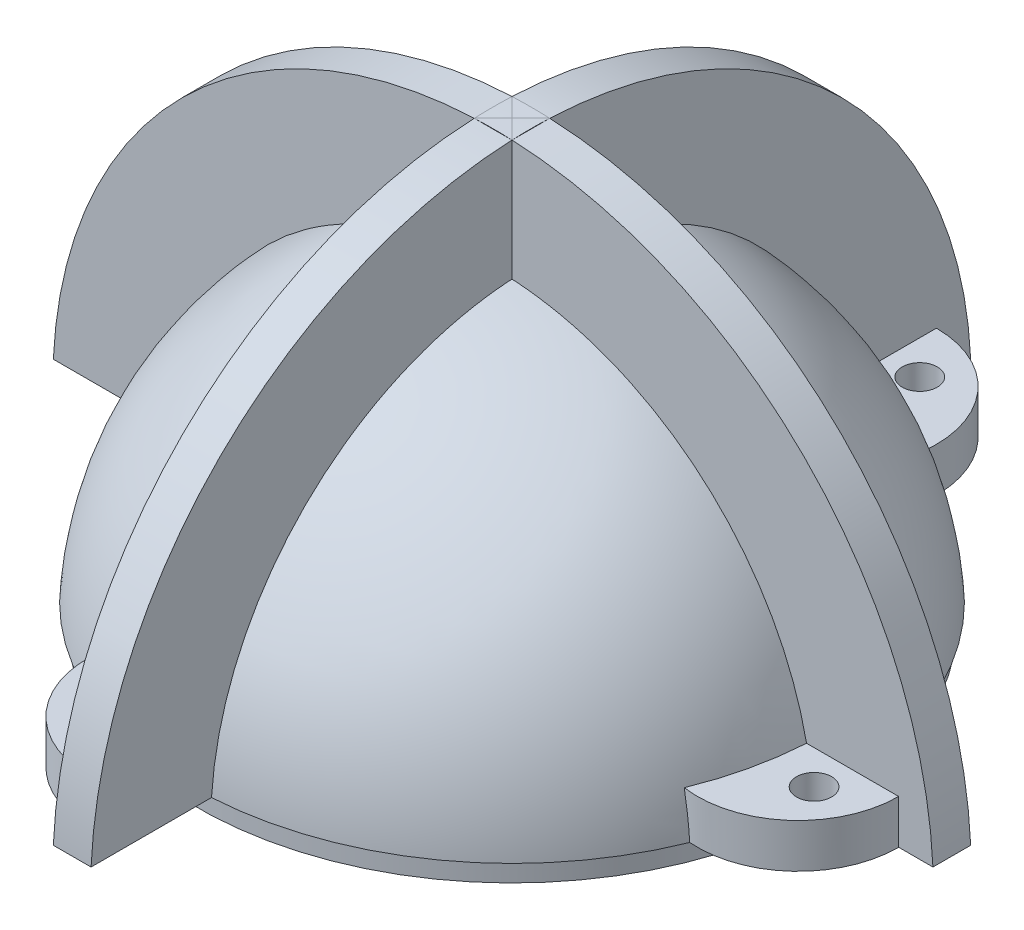
ISO-10303-21;
HEADER;
FILE_DESCRIPTION(('STEP AP214'),'2;1');
FILE_NAME('part.step','',(''),(''),'','','');
FILE_SCHEMA(('AUTOMOTIVE_DESIGN { 1 0 10303 214 1 1 1 1 }'));
ENDSEC;
DATA;
#1=APPLICATION_CONTEXT('core data for automotive mechanical design processes');
#2=APPLICATION_PROTOCOL_DEFINITION('international standard','automotive_design',2000,#1);
#3=PRODUCT_CONTEXT('',#1,'mechanical');
#4=PRODUCT('Part','Part','',(#3));
#5=PRODUCT_RELATED_PRODUCT_CATEGORY('part','',(#4));
#6=PRODUCT_DEFINITION_FORMATION('','',#4);
#7=PRODUCT_DEFINITION_CONTEXT('part definition',#1,'design');
#8=PRODUCT_DEFINITION('design','',#6,#7);
#9=PRODUCT_DEFINITION_SHAPE('','',#8);
#10=(LENGTH_UNIT() NAMED_UNIT(*) SI_UNIT(.MILLI.,.METRE.));
#11=(NAMED_UNIT(*) PLANE_ANGLE_UNIT() SI_UNIT($,.RADIAN.));
#12=(NAMED_UNIT(*) SI_UNIT($,.STERADIAN.) SOLID_ANGLE_UNIT());
#13=UNCERTAINTY_MEASURE_WITH_UNIT(LENGTH_MEASURE(1.E-05),#10,'distance_accuracy_value','');
#14=(GEOMETRIC_REPRESENTATION_CONTEXT(3) GLOBAL_UNCERTAINTY_ASSIGNED_CONTEXT((#13)) GLOBAL_UNIT_ASSIGNED_CONTEXT((#10,
#11,#12)) REPRESENTATION_CONTEXT('',''));
#15=CARTESIAN_POINT('',(0.,0.,0.));
#16=DIRECTION('',(0.,0.,1.));
#17=DIRECTION('',(1.,0.,0.));
#18=AXIS2_PLACEMENT_3D('',#15,#16,#17);
#19=CARTESIAN_POINT('',(0.,0.,0.));
#20=DIRECTION('',(0.,1.,0.));
#21=DIRECTION('',(0.,0.,1.));
#22=AXIS2_PLACEMENT_3D('',#19,#20,#21);
#23=PLANE('',#22);
#24=CARTESIAN_POINT('',(0.,0.,0.));
#25=DIRECTION('',(0.,-1.,0.));
#26=DIRECTION('',(0.,0.,-1.));
#27=AXIS2_PLACEMENT_3D('',#24,#25,#26);
#28=CIRCLE('',#27,24.285);
#29=CARTESIAN_POINT('',(0.,0.,-24.285));
#30=VERTEX_POINT('',#29);
#31=EDGE_CURVE('E442',#30,#30,#28,.T.);
#32=ORIENTED_EDGE('',*,*,#31,.F.);
#33=EDGE_LOOP('',(#32));
#34=FACE_BOUND('',#33,.T.);
#35=CARTESIAN_POINT('',(0.,0.,0.));
#36=DIRECTION('',(0.,-1.,0.));
#37=DIRECTION('',(0.,0.,-1.));
#38=AXIS2_PLACEMENT_3D('',#35,#36,#37);
#39=CIRCLE('',#38,25.);
#40=CARTESIAN_POINT('',(0.,0.,-25.));
#41=VERTEX_POINT('',#40);
#42=EDGE_CURVE('E390',#41,#41,#39,.T.);
#43=ORIENTED_EDGE('',*,*,#42,.T.);
#44=EDGE_LOOP('',(#43));
#45=FACE_BOUND('',#44,.T.);
#46=ADVANCED_FACE('F38',(#34,#45),#23,.F.);
#47=CARTESIAN_POINT('',(0.,0.,0.));
#48=DIRECTION('',(0.,-1.,0.));
#49=DIRECTION('',(0.,0.,-1.));
#50=AXIS2_PLACEMENT_3D('',#47,#48,#49);
#51=CYLINDRICAL_SURFACE('',#50,20.885);
#52=CARTESIAN_POINT('',(0.,11.7939391214301,0.));
#53=DIRECTION('',(0.,-1.,0.));
#54=DIRECTION('',(0.,0.,-1.));
#55=AXIS2_PLACEMENT_3D('',#52,#53,#54);
#56=CIRCLE('',#55,20.885);
#57=CARTESIAN_POINT('',(0.,11.7939391214301,-20.885));
#58=VERTEX_POINT('',#57);
#59=EDGE_CURVE('E356',#58,#58,#56,.T.);
#60=ORIENTED_EDGE('',*,*,#59,.F.);
#61=EDGE_LOOP('',(#60));
#62=FACE_BOUND('',#61,.T.);
#63=CARTESIAN_POINT('',(0.,0.,0.));
#64=DIRECTION('',(0.,-1.,0.));
#65=DIRECTION('',(0.,0.,-1.));
#66=AXIS2_PLACEMENT_3D('',#63,#64,#65);
#67=CIRCLE('',#66,20.885);
#68=CARTESIAN_POINT('',(0.,0.,-20.885));
#69=VERTEX_POINT('',#68);
#70=EDGE_CURVE('E432',#69,#69,#67,.T.);
#71=ORIENTED_EDGE('',*,*,#70,.T.);
#72=EDGE_LOOP('',(#71));
#73=FACE_BOUND('',#72,.T.);
#74=ADVANCED_FACE('F40',(#62,#73),#51,.F.);
#75=CARTESIAN_POINT('',(0.,0.,0.));
#76=DIRECTION('',(0.,-1.,0.));
#77=DIRECTION('',(-1.,0.,0.));
#78=AXIS2_PLACEMENT_3D('',#75,#76,#77);
#79=SPHERICAL_SURFACE('',#78,23.985);
#80=ORIENTED_EDGE('',*,*,#59,.T.);
#81=EDGE_LOOP('',(#80));
#82=FACE_BOUND('',#81,.T.);
#83=ADVANCED_FACE('F409',(#82),#79,.F.);
#84=CARTESIAN_POINT('',(0.,0.,0.));
#85=DIRECTION('',(0.,-1.,0.));
#86=DIRECTION('',(0.,0.,-1.));
#87=AXIS2_PLACEMENT_3D('',#84,#85,#86);
#88=CYLINDRICAL_SURFACE('',#87,24.285);
#89=CARTESIAN_POINT('',(0.,0.5,0.));
#90=DIRECTION('',(0.,-1.,0.));
#91=DIRECTION('',(0.,0.,-1.));
#92=AXIS2_PLACEMENT_3D('',#89,#90,#91);
#93=CIRCLE('',#92,24.285);
#94=CARTESIAN_POINT('',(0.,0.5,-24.285));
#95=VERTEX_POINT('',#94);
#96=EDGE_CURVE('E434',#95,#95,#93,.T.);
#97=ORIENTED_EDGE('',*,*,#96,.F.);
#98=EDGE_LOOP('',(#97));
#99=FACE_BOUND('',#98,.T.);
#100=ORIENTED_EDGE('',*,*,#31,.T.);
#101=EDGE_LOOP('',(#100));
#102=FACE_BOUND('',#101,.T.);
#103=ADVANCED_FACE('F413',(#99,#102),#88,.F.);
#104=CARTESIAN_POINT('',(0.,0.5,0.));
#105=DIRECTION('',(0.,1.,0.));
#106=DIRECTION('',(0.,0.,1.));
#107=AXIS2_PLACEMENT_3D('',#104,#105,#106);
#108=PLANE('',#107);
#109=CARTESIAN_POINT('',(0.,0.5,0.));
#110=DIRECTION('',(0.,-1.,0.));
#111=DIRECTION('',(0.,0.,-1.));
#112=AXIS2_PLACEMENT_3D('',#109,#110,#111);
#113=CIRCLE('',#112,22.085);
#114=CARTESIAN_POINT('',(0.,0.5,-22.085));
#115=VERTEX_POINT('',#114);
#116=EDGE_CURVE('E427',#115,#115,#113,.T.);
#117=ORIENTED_EDGE('',*,*,#116,.F.);
#118=EDGE_LOOP('',(#117));
#119=FACE_BOUND('',#118,.T.);
#120=ORIENTED_EDGE('',*,*,#96,.T.);
#121=EDGE_LOOP('',(#120));
#122=FACE_BOUND('',#121,.T.);
#123=ADVANCED_FACE('F416',(#119,#122),#108,.F.);
#124=CARTESIAN_POINT('',(0.,0.,0.));
#125=DIRECTION('',(0.,-1.,0.));
#126=DIRECTION('',(0.,0.,-1.));
#127=AXIS2_PLACEMENT_3D('',#124,#125,#126);
#128=CYLINDRICAL_SURFACE('',#127,22.085);
#129=ORIENTED_EDGE('',*,*,#116,.T.);
#130=EDGE_LOOP('',(#129));
#131=FACE_BOUND('',#130,.T.);
#132=CARTESIAN_POINT('',(0.,0.,0.));
#133=DIRECTION('',(0.,-1.,0.));
#134=DIRECTION('',(0.,0.,-1.));
#135=AXIS2_PLACEMENT_3D('',#132,#133,#134);
#136=CIRCLE('',#135,22.085);
#137=CARTESIAN_POINT('',(0.,0.,-22.085));
#138=VERTEX_POINT('',#137);
#139=EDGE_CURVE('E430',#138,#138,#136,.T.);
#140=ORIENTED_EDGE('',*,*,#139,.F.);
#141=EDGE_LOOP('',(#140));
#142=FACE_BOUND('',#141,.T.);
#143=ADVANCED_FACE('F401',(#131,#142),#128,.T.);
#144=CARTESIAN_POINT('',(0.,0.,0.));
#145=DIRECTION('',(0.,1.,0.));
#146=DIRECTION('',(0.,0.,1.));
#147=AXIS2_PLACEMENT_3D('',#144,#145,#146);
#148=PLANE('',#147);
#149=ORIENTED_EDGE('',*,*,#70,.F.);
#150=EDGE_LOOP('',(#149));
#151=FACE_BOUND('',#150,.T.);
#152=ORIENTED_EDGE('',*,*,#139,.T.);
#153=EDGE_LOOP('',(#152));
#154=FACE_BOUND('',#153,.T.);
#155=ADVANCED_FACE('F344',(#151,#154),#148,.F.);
#156=CARTESIAN_POINT('',(0.,75.1891052434009,0.));
#157=DIRECTION('',(0.,-1.,0.));
#158=DIRECTION('',(0.,0.,-1.));
#159=AXIS2_PLACEMENT_3D('',#156,#157,#158);
#160=CYLINDRICAL_SURFACE('',#159,25.);
#161=CARTESIAN_POINT('',(0.,1.65,0.));
#162=DIRECTION('',(0.,-1.,0.));
#163=DIRECTION('',(0.,0.,-1.));
#164=AXIS2_PLACEMENT_3D('',#161,#162,#163);
#165=CIRCLE('',#164,25.);
#166=CARTESIAN_POINT('',(0.,1.65,-25.));
#167=VERTEX_POINT('',#166);
#168=EDGE_CURVE('E387',#167,#167,#165,.F.);
#169=ORIENTED_EDGE('',*,*,#168,.F.);
#170=EDGE_LOOP('',(#169));
#171=FACE_BOUND('',#170,.T.);
#172=ORIENTED_EDGE('',*,*,#42,.F.);
#173=EDGE_LOOP('',(#172));
#174=FACE_BOUND('',#173,.T.);
#175=ADVANCED_FACE('F313',(#171,#174),#160,.T.);
#176=CARTESIAN_POINT('',(-1.5,0.,0.));
#177=DIRECTION('',(1.,0.,0.));
#178=DIRECTION('',(0.,0.,-1.));
#179=AXIS2_PLACEMENT_3D('',#176,#177,#178);
#180=CYLINDRICAL_SURFACE('',#179,35.);
#181=CARTESIAN_POINT('',(-1.5,0.,0.));
#182=DIRECTION('',(1.,0.,0.));
#183=DIRECTION('',(0.,0.,-1.));
#184=AXIS2_PLACEMENT_3D('',#181,#182,#183);
#185=CIRCLE('',#184,35.);
#186=CARTESIAN_POINT('',(-1.5,34.9678423698117,-1.5));
#187=VERTEX_POINT('',#186);
#188=CARTESIAN_POINT('',(-1.5,34.9678423698117,1.5));
#189=VERTEX_POINT('',#188);
#190=EDGE_CURVE('E840',#187,#189,#185,.T.);
#191=ORIENTED_EDGE('',*,*,#190,.T.);
#192=CARTESIAN_POINT('',(0.,0.,0.));
#193=DIRECTION('',(0.707106781186547,0.,0.707106781186547));
#194=DIRECTION('',(-0.707106781186547,0.,0.707106781186547));
#195=AXIS2_PLACEMENT_3D('',#192,#193,#194);
#196=ELLIPSE('',#195,49.4974746830583,35.);
#197=CARTESIAN_POINT('',(0.,35.,0.));
#198=VERTEX_POINT('',#197);
#199=EDGE_CURVE('E850',#189,#198,#196,.F.);
#200=ORIENTED_EDGE('',*,*,#199,.T.);
#201=CARTESIAN_POINT('',(0.,0.,0.));
#202=DIRECTION('',(-0.707106781186547,0.,0.707106781186547));
#203=DIRECTION('',(0.707106781186547,0.,0.707106781186547));
#204=AXIS2_PLACEMENT_3D('',#201,#202,#203);
#205=ELLIPSE('',#204,49.4974746830583,35.);
#206=EDGE_CURVE('E847',#198,#187,#205,.T.);
#207=ORIENTED_EDGE('',*,*,#206,.T.);
#208=EDGE_LOOP('',(#191,#200,#207));
#209=FACE_BOUND('',#208,.T.);
#210=ADVANCED_FACE('F309',(#209),#180,.T.);
#211=CARTESIAN_POINT('',(0.,0.,-1.5));
#212=DIRECTION('',(0.,0.,1.));
#213=DIRECTION('',(1.,0.,0.));
#214=AXIS2_PLACEMENT_3D('',#211,#212,#213);
#215=CYLINDRICAL_SURFACE('',#214,35.);
#216=ORIENTED_EDGE('',*,*,#199,.F.);
#217=CARTESIAN_POINT('',(0.,0.,1.5));
#218=DIRECTION('',(0.,0.,1.));
#219=DIRECTION('',(-1.,0.,0.));
#220=AXIS2_PLACEMENT_3D('',#217,#218,#219);
#221=CIRCLE('',#220,35.);
#222=CARTESIAN_POINT('',(1.5,34.9678423698117,1.5));
#223=VERTEX_POINT('',#222);
#224=EDGE_CURVE('E862',#223,#189,#221,.T.);
#225=ORIENTED_EDGE('',*,*,#224,.F.);
#226=CARTESIAN_POINT('',(0.,0.,0.));
#227=DIRECTION('',(-0.707106781186547,0.,0.707106781186547));
#228=DIRECTION('',(0.707106781186547,0.,0.707106781186547));
#229=AXIS2_PLACEMENT_3D('',#226,#227,#228);
#230=ELLIPSE('',#229,49.4974746830583,35.);
#231=EDGE_CURVE('E772',#198,#223,#230,.F.);
#232=ORIENTED_EDGE('',*,*,#231,.F.);
#233=EDGE_LOOP('',(#216,#225,#232));
#234=FACE_BOUND('',#233,.T.);
#235=ADVANCED_FACE('F312',(#234),#215,.T.);
#236=CARTESIAN_POINT('',(1.5,0.,0.));
#237=DIRECTION('',(1.,0.,0.));
#238=DIRECTION('',(0.,0.,-1.));
#239=AXIS2_PLACEMENT_3D('',#236,#237,#238);
#240=CIRCLE('',#239,35.);
#241=CARTESIAN_POINT('',(1.5,34.9678423698117,-1.5));
#242=VERTEX_POINT('',#241);
#243=EDGE_CURVE('E836',#242,#223,#240,.T.);
#244=ORIENTED_EDGE('',*,*,#243,.F.);
#245=CARTESIAN_POINT('',(0.,0.,0.));
#246=DIRECTION('',(0.707106781186547,0.,0.707106781186547));
#247=DIRECTION('',(-0.707106781186547,0.,0.707106781186547));
#248=AXIS2_PLACEMENT_3D('',#245,#246,#247);
#249=ELLIPSE('',#248,49.4974746830583,35.);
#250=EDGE_CURVE('E856',#242,#198,#249,.T.);
#251=ORIENTED_EDGE('',*,*,#250,.T.);
#252=ORIENTED_EDGE('',*,*,#231,.T.);
#253=EDGE_LOOP('',(#244,#251,#252));
#254=FACE_BOUND('',#253,.T.);
#255=ADVANCED_FACE('F315',(#254),#180,.T.);
#256=ORIENTED_EDGE('',*,*,#250,.F.);
#257=CARTESIAN_POINT('',(0.,0.,-1.5));
#258=DIRECTION('',(0.,0.,1.));
#259=DIRECTION('',(-1.,0.,0.));
#260=AXIS2_PLACEMENT_3D('',#257,#258,#259);
#261=CIRCLE('',#260,35.);
#262=EDGE_CURVE('E867',#242,#187,#261,.T.);
#263=ORIENTED_EDGE('',*,*,#262,.T.);
#264=ORIENTED_EDGE('',*,*,#206,.F.);
#265=EDGE_LOOP('',(#256,#263,#264));
#266=FACE_BOUND('',#265,.T.);
#267=ADVANCED_FACE('F305',(#266),#215,.T.);
#268=CARTESIAN_POINT('',(-1.5,0.,0.));
#269=DIRECTION('',(1.,0.,0.));
#270=DIRECTION('',(0.,0.,-1.));
#271=AXIS2_PLACEMENT_3D('',#268,#269,#270);
#272=PLANE('',#271);
#273=DIRECTION('',(0.,0.,1.));
#274=VECTOR('',#273,1.);
#275=CARTESIAN_POINT('',(-1.5,34.9678423698117,-1.5));
#276=LINE('',#275,#274);
#277=EDGE_CURVE('E773',#189,#187,#276,.F.);
#278=ORIENTED_EDGE('',*,*,#277,.F.);
#279=ORIENTED_EDGE('',*,*,#190,.F.);
#280=EDGE_LOOP('',(#278,#279));
#281=FACE_BOUND('',#280,.T.);
#282=ADVANCED_FACE('F302',(#281),#272,.F.);
#283=CARTESIAN_POINT('',(0.,0.,1.5));
#284=DIRECTION('',(0.,0.,-1.));
#285=DIRECTION('',(-1.,0.,0.));
#286=AXIS2_PLACEMENT_3D('',#283,#284,#285);
#287=PLANE('',#286);
#288=ORIENTED_EDGE('',*,*,#224,.T.);
#289=DIRECTION('',(1.,0.,0.));
#290=VECTOR('',#289,1.);
#291=CARTESIAN_POINT('',(-1.5,34.9678423698117,1.5));
#292=LINE('',#291,#290);
#293=EDGE_CURVE('E870',#189,#223,#292,.T.);
#294=ORIENTED_EDGE('',*,*,#293,.T.);
#295=EDGE_LOOP('',(#288,#294));
#296=FACE_BOUND('',#295,.T.);
#297=ADVANCED_FACE('F300',(#296),#287,.F.);
#298=CARTESIAN_POINT('',(1.5,0.,0.));
#299=DIRECTION('',(1.,0.,0.));
#300=DIRECTION('',(0.,0.,-1.));
#301=AXIS2_PLACEMENT_3D('',#298,#299,#300);
#302=PLANE('',#301);
#303=ORIENTED_EDGE('',*,*,#243,.T.);
#304=DIRECTION('',(0.,0.,1.));
#305=VECTOR('',#304,1.);
#306=CARTESIAN_POINT('',(1.5,34.9678423698117,-1.5));
#307=LINE('',#306,#305);
#308=EDGE_CURVE('E839',#223,#242,#307,.F.);
#309=ORIENTED_EDGE('',*,*,#308,.T.);
#310=EDGE_LOOP('',(#303,#309));
#311=FACE_BOUND('',#310,.T.);
#312=ADVANCED_FACE('F296',(#311),#302,.T.);
#313=CARTESIAN_POINT('',(0.,0.,-1.5));
#314=DIRECTION('',(0.,0.,-1.));
#315=DIRECTION('',(-1.,0.,0.));
#316=AXIS2_PLACEMENT_3D('',#313,#314,#315);
#317=PLANE('',#316);
#318=DIRECTION('',(1.,0.,0.));
#319=VECTOR('',#318,1.);
#320=CARTESIAN_POINT('',(-1.5,34.9678423698117,-1.5));
#321=LINE('',#320,#319);
#322=EDGE_CURVE('E853',#187,#242,#321,.T.);
#323=ORIENTED_EDGE('',*,*,#322,.F.);
#324=ORIENTED_EDGE('',*,*,#262,.F.);
#325=EDGE_LOOP('',(#323,#324));
#326=FACE_BOUND('',#325,.T.);
#327=ADVANCED_FACE('F299',(#326),#317,.T.);
#328=CARTESIAN_POINT('',(-28.212839524984,5.15,-4.2));
#329=DIRECTION('',(0.,-1.,0.));
#330=DIRECTION('',(0.,0.,-1.));
#331=AXIS2_PLACEMENT_3D('',#328,#329,#330);
#332=CYLINDRICAL_SURFACE('',#331,1.4);
#333=CARTESIAN_POINT('',(-28.212839524984,5.15,-4.2));
#334=DIRECTION('',(0.,-1.,0.));
#335=DIRECTION('',(0.,0.,-1.));
#336=AXIS2_PLACEMENT_3D('',#333,#334,#335);
#337=CIRCLE('',#336,1.4);
#338=CARTESIAN_POINT('',(-28.212839524984,5.15,-5.6));
#339=VERTEX_POINT('',#338);
#340=EDGE_CURVE('E781',#339,#339,#337,.T.);
#341=ORIENTED_EDGE('',*,*,#340,.F.);
#342=EDGE_LOOP('',(#341));
#343=FACE_BOUND('',#342,.T.);
#344=CARTESIAN_POINT('',(-28.212839524984,1.65,-4.2));
#345=DIRECTION('',(0.,-1.,0.));
#346=DIRECTION('',(0.,0.,-1.));
#347=AXIS2_PLACEMENT_3D('',#344,#345,#346);
#348=CIRCLE('',#347,1.4);
#349=CARTESIAN_POINT('',(-28.212839524984,1.65,-5.6));
#350=VERTEX_POINT('',#349);
#351=EDGE_CURVE('E777',#350,#350,#348,.T.);
#352=ORIENTED_EDGE('',*,*,#351,.T.);
#353=EDGE_LOOP('',(#352));
#354=FACE_BOUND('',#353,.T.);
#355=ADVANCED_FACE('F329',(#343,#354),#332,.F.);
#356=DIRECTION('',(0.,0.,1.));
#357=VECTOR('',#356,1.);
#358=CARTESIAN_POINT('',(-34.9610855094632,1.65,-1.5));
#359=LINE('',#358,#357);
#360=CARTESIAN_POINT('',(-34.9610855094632,1.65,1.5));
#361=VERTEX_POINT('',#360);
#362=CARTESIAN_POINT('',(-34.9610855094632,1.65,-1.5));
#363=VERTEX_POINT('',#362);
#364=EDGE_CURVE('E830',#361,#363,#359,.F.);
#365=ORIENTED_EDGE('',*,*,#364,.F.);
#366=EDGE_CURVE('E859',#189,#361,#221,.T.);
#367=ORIENTED_EDGE('',*,*,#366,.F.);
#368=ORIENTED_EDGE('',*,*,#277,.T.);
#369=EDGE_CURVE('E771',#187,#363,#261,.T.);
#370=ORIENTED_EDGE('',*,*,#369,.T.);
#371=EDGE_LOOP('',(#365,#367,#368,#370));
#372=FACE_BOUND('',#371,.T.);
#373=ADVANCED_FACE('F328',(#372),#215,.T.);
#374=CARTESIAN_POINT('',(-4.2,5.15,28.212839524984));
#375=DIRECTION('',(0.,-1.,0.));
#376=DIRECTION('',(0.,0.,-1.));
#377=AXIS2_PLACEMENT_3D('',#374,#375,#376);
#378=CYLINDRICAL_SURFACE('',#377,1.4);
#379=CARTESIAN_POINT('',(-4.2,5.15,28.212839524984));
#380=DIRECTION('',(0.,-1.,0.));
#381=DIRECTION('',(0.,0.,-1.));
#382=AXIS2_PLACEMENT_3D('',#379,#380,#381);
#383=CIRCLE('',#382,1.4);
#384=CARTESIAN_POINT('',(-4.2,5.15,26.812839524984));
#385=VERTEX_POINT('',#384);
#386=EDGE_CURVE('E264',#385,#385,#383,.T.);
#387=ORIENTED_EDGE('',*,*,#386,.F.);
#388=EDGE_LOOP('',(#387));
#389=FACE_BOUND('',#388,.T.);
#390=CARTESIAN_POINT('',(-4.2,1.65,28.212839524984));
#391=DIRECTION('',(0.,-1.,0.));
#392=DIRECTION('',(0.,0.,-1.));
#393=AXIS2_PLACEMENT_3D('',#390,#391,#392);
#394=CIRCLE('',#393,1.4);
#395=CARTESIAN_POINT('',(-4.2,1.65,26.812839524984));
#396=VERTEX_POINT('',#395);
#397=EDGE_CURVE('E263',#396,#396,#394,.T.);
#398=ORIENTED_EDGE('',*,*,#397,.T.);
#399=EDGE_LOOP('',(#398));
#400=FACE_BOUND('',#399,.T.);
#401=ADVANCED_FACE('F250',(#389,#400),#378,.F.);
#402=DIRECTION('',(1.,0.,0.));
#403=VECTOR('',#402,1.);
#404=CARTESIAN_POINT('',(-1.5,1.65,34.9610855094632));
#405=LINE('',#404,#403);
#406=CARTESIAN_POINT('',(1.5,1.65,34.9610855094632));
#407=VERTEX_POINT('',#406);
#408=CARTESIAN_POINT('',(-1.5,1.65,34.9610855094632));
#409=VERTEX_POINT('',#408);
#410=EDGE_CURVE('E824',#407,#409,#405,.F.);
#411=ORIENTED_EDGE('',*,*,#410,.F.);
#412=EDGE_CURVE('E832',#223,#407,#240,.T.);
#413=ORIENTED_EDGE('',*,*,#412,.F.);
#414=ORIENTED_EDGE('',*,*,#293,.F.);
#415=EDGE_CURVE('E835',#189,#409,#185,.T.);
#416=ORIENTED_EDGE('',*,*,#415,.T.);
#417=EDGE_LOOP('',(#411,#413,#414,#416));
#418=FACE_BOUND('',#417,.T.);
#419=ADVANCED_FACE('F235',(#418),#180,.T.);
#420=CARTESIAN_POINT('',(28.212839524984,5.15,4.2));
#421=DIRECTION('',(0.,-1.,0.));
#422=DIRECTION('',(0.,0.,-1.));
#423=AXIS2_PLACEMENT_3D('',#420,#421,#422);
#424=CYLINDRICAL_SURFACE('',#423,1.4);
#425=CARTESIAN_POINT('',(28.212839524984,5.15,4.2));
#426=DIRECTION('',(0.,-1.,0.));
#427=DIRECTION('',(0.,0.,-1.));
#428=AXIS2_PLACEMENT_3D('',#425,#426,#427);
#429=CIRCLE('',#428,1.4);
#430=CARTESIAN_POINT('',(28.212839524984,5.15,2.8));
#431=VERTEX_POINT('',#430);
#432=EDGE_CURVE('E908',#431,#431,#429,.T.);
#433=ORIENTED_EDGE('',*,*,#432,.F.);
#434=EDGE_LOOP('',(#433));
#435=FACE_BOUND('',#434,.T.);
#436=CARTESIAN_POINT('',(28.212839524984,1.65,4.2));
#437=DIRECTION('',(0.,-1.,0.));
#438=DIRECTION('',(0.,0.,-1.));
#439=AXIS2_PLACEMENT_3D('',#436,#437,#438);
#440=CIRCLE('',#439,1.4);
#441=CARTESIAN_POINT('',(28.212839524984,1.65,2.8));
#442=VERTEX_POINT('',#441);
#443=EDGE_CURVE('E211',#442,#442,#440,.T.);
#444=ORIENTED_EDGE('',*,*,#443,.T.);
#445=EDGE_LOOP('',(#444));
#446=FACE_BOUND('',#445,.T.);
#447=ADVANCED_FACE('F231',(#435,#446),#424,.F.);
#448=DIRECTION('',(0.,0.,1.));
#449=VECTOR('',#448,1.);
#450=CARTESIAN_POINT('',(34.9610855094632,1.65,-1.5));
#451=LINE('',#450,#449);
#452=CARTESIAN_POINT('',(34.9610855094632,1.65,-1.5));
#453=VERTEX_POINT('',#452);
#454=CARTESIAN_POINT('',(34.9610855094632,1.65,1.5));
#455=VERTEX_POINT('',#454);
#456=EDGE_CURVE('E778',#453,#455,#451,.T.);
#457=ORIENTED_EDGE('',*,*,#456,.F.);
#458=EDGE_CURVE('E863',#453,#242,#261,.T.);
#459=ORIENTED_EDGE('',*,*,#458,.T.);
#460=ORIENTED_EDGE('',*,*,#308,.F.);
#461=EDGE_CURVE('E860',#455,#223,#221,.T.);
#462=ORIENTED_EDGE('',*,*,#461,.F.);
#463=EDGE_LOOP('',(#457,#459,#460,#462));
#464=FACE_BOUND('',#463,.T.);
#465=ADVANCED_FACE('F234',(#464),#215,.T.);
#466=CARTESIAN_POINT('',(4.2,5.15,-28.212839524984));
#467=DIRECTION('',(0.,-1.,0.));
#468=DIRECTION('',(0.,0.,-1.));
#469=AXIS2_PLACEMENT_3D('',#466,#467,#468);
#470=CYLINDRICAL_SURFACE('',#469,1.4);
#471=CARTESIAN_POINT('',(4.2,5.15,-28.212839524984));
#472=DIRECTION('',(0.,-1.,0.));
#473=DIRECTION('',(0.,0.,-1.));
#474=AXIS2_PLACEMENT_3D('',#471,#472,#473);
#475=CIRCLE('',#474,1.4);
#476=CARTESIAN_POINT('',(4.2,5.15,-29.612839524984));
#477=VERTEX_POINT('',#476);
#478=EDGE_CURVE('E193',#477,#477,#475,.T.);
#479=ORIENTED_EDGE('',*,*,#478,.F.);
#480=EDGE_LOOP('',(#479));
#481=FACE_BOUND('',#480,.T.);
#482=CARTESIAN_POINT('',(4.2,1.65,-28.212839524984));
#483=DIRECTION('',(0.,-1.,0.));
#484=DIRECTION('',(0.,0.,-1.));
#485=AXIS2_PLACEMENT_3D('',#482,#483,#484);
#486=CIRCLE('',#485,1.4);
#487=CARTESIAN_POINT('',(4.2,1.65,-29.612839524984));
#488=VERTEX_POINT('',#487);
#489=EDGE_CURVE('E381',#488,#488,#486,.T.);
#490=ORIENTED_EDGE('',*,*,#489,.T.);
#491=EDGE_LOOP('',(#490));
#492=FACE_BOUND('',#491,.T.);
#493=ADVANCED_FACE('F326',(#481,#492),#470,.F.);
#494=DIRECTION('',(1.,0.,0.));
#495=VECTOR('',#494,1.);
#496=CARTESIAN_POINT('',(-1.5,1.65,-34.9610855094632));
#497=LINE('',#496,#495);
#498=CARTESIAN_POINT('',(-1.5,1.65,-34.9610855094632));
#499=VERTEX_POINT('',#498);
#500=CARTESIAN_POINT('',(1.5,1.65,-34.9610855094632));
#501=VERTEX_POINT('',#500);
#502=EDGE_CURVE('E814',#499,#501,#497,.T.);
#503=ORIENTED_EDGE('',*,*,#502,.F.);
#504=EDGE_CURVE('E837',#499,#187,#185,.T.);
#505=ORIENTED_EDGE('',*,*,#504,.T.);
#506=ORIENTED_EDGE('',*,*,#322,.T.);
#507=EDGE_CURVE('E833',#501,#242,#240,.T.);
#508=ORIENTED_EDGE('',*,*,#507,.F.);
#509=EDGE_LOOP('',(#503,#505,#506,#508));
#510=FACE_BOUND('',#509,.T.);
#511=ADVANCED_FACE('F499',(#510),#180,.T.);
#512=DIRECTION('',(0.,-1.,0.));
#513=VECTOR('',#512,1.);
#514=CARTESIAN_POINT('',(-1.5,0.,-1.5));
#515=LINE('',#514,#513);
#516=CARTESIAN_POINT('',(-1.5,25.3965593142063,-1.5));
#517=VERTEX_POINT('',#516);
#518=EDGE_CURVE('E761',#187,#517,#515,.T.);
#519=ORIENTED_EDGE('',*,*,#518,.T.);
#520=CARTESIAN_POINT('',(0.,0.,-1.5));
#521=DIRECTION('',(0.,0.,-1.));
#522=DIRECTION('',(-1.,0.,0.));
#523=AXIS2_PLACEMENT_3D('',#520,#521,#522);
#524=CIRCLE('',#523,25.4408180882612);
#525=CARTESIAN_POINT('',(-24.9141069476712,5.15,-1.5));
#526=VERTEX_POINT('',#525);
#527=EDGE_CURVE('E768',#517,#526,#524,.F.);
#528=ORIENTED_EDGE('',*,*,#527,.T.);
#529=DIRECTION('',(-1.,0.,0.));
#530=VECTOR('',#529,1.);
#531=CARTESIAN_POINT('',(-32.2386308400454,5.15,-1.5));
#532=LINE('',#531,#530);
#533=CARTESIAN_POINT('',(-32.2386308400454,5.15,-1.5));
#534=VERTEX_POINT('',#533);
#535=EDGE_CURVE('E794',#526,#534,#532,.T.);
#536=ORIENTED_EDGE('',*,*,#535,.T.);
#537=DIRECTION('',(0.,-1.,0.));
#538=VECTOR('',#537,1.);
#539=CARTESIAN_POINT('',(-32.2386308400454,5.15,-1.5));
#540=LINE('',#539,#538);
#541=CARTESIAN_POINT('',(-32.2386308400454,1.65,-1.5));
#542=VERTEX_POINT('',#541);
#543=EDGE_CURVE('E437',#534,#542,#540,.T.);
#544=ORIENTED_EDGE('',*,*,#543,.T.);
#545=DIRECTION('',(1.,0.,0.));
#546=VECTOR('',#545,1.);
#547=CARTESIAN_POINT('',(0.,1.65,-1.5));
#548=LINE('',#547,#546);
#549=EDGE_CURVE('E799',#363,#542,#548,.T.);
#550=ORIENTED_EDGE('',*,*,#549,.F.);
#551=ORIENTED_EDGE('',*,*,#369,.F.);
#552=EDGE_LOOP('',(#519,#528,#536,#544,#550,#551));
#553=FACE_BOUND('',#552,.T.);
#554=ADVANCED_FACE('F323',(#553),#317,.T.);
#555=CARTESIAN_POINT('',(-24.2386308400454,5.15,-1.5));
#556=DIRECTION('',(0.,-1.,0.));
#557=DIRECTION('',(0.,0.,-1.));
#558=AXIS2_PLACEMENT_3D('',#555,#556,#557);
#559=PLANE('',#558);
#560=CARTESIAN_POINT('',(0.,5.15,0.));
#561=DIRECTION('',(0.,-1.,0.));
#562=DIRECTION('',(0.,0.,-1.));
#563=AXIS2_PLACEMENT_3D('',#560,#561,#562);
#564=CIRCLE('',#563,24.9592212418577);
#565=CARTESIAN_POINT('',(-23.1131586653255,5.15,-9.42043637585274));
#566=VERTEX_POINT('',#565);
#567=EDGE_CURVE('E355',#566,#526,#564,.F.);
#568=ORIENTED_EDGE('',*,*,#567,.F.);
#569=CARTESIAN_POINT('',(-24.2386308400454,5.15,-1.5));
#570=DIRECTION('',(0.,-1.,0.));
#571=DIRECTION('',(0.,0.,-1.));
#572=AXIS2_PLACEMENT_3D('',#569,#570,#571);
#573=CIRCLE('',#572,8.);
#574=EDGE_CURVE('E791',#534,#566,#573,.T.);
#575=ORIENTED_EDGE('',*,*,#574,.F.);
#576=ORIENTED_EDGE('',*,*,#535,.F.);
#577=EDGE_LOOP('',(#568,#575,#576));
#578=FACE_BOUND('',#577,.T.);
#579=ORIENTED_EDGE('',*,*,#340,.T.);
#580=EDGE_LOOP('',(#579));
#581=FACE_BOUND('',#580,.T.);
#582=ADVANCED_FACE('F333',(#578,#581),#559,.F.);
#583=CARTESIAN_POINT('',(-24.2386308400454,5.15,-1.5));
#584=DIRECTION('',(0.,-1.,0.));
#585=DIRECTION('',(0.,0.,-1.));
#586=AXIS2_PLACEMENT_3D('',#583,#584,#585);
#587=CYLINDRICAL_SURFACE('',#586,8.);
#588=ORIENTED_EDGE('',*,*,#574,.T.);
#589=CARTESIAN_POINT('',(-23.1131165407862,5.1502,-9.42043038995755));
#590=CARTESIAN_POINT('',(-23.1738961391219,4.86167592290069,-9.42905055258149));
#591=CARTESIAN_POINT('',(-23.2298200702692,4.57208473180857,-9.43630056429791));
#592=CARTESIAN_POINT('',(-23.3316174918336,3.99147152831069,-9.44858589380943));
#593=CARTESIAN_POINT('',(-23.3775035614627,3.70045177946322,-9.4536239915932));
#594=CARTESIAN_POINT('',(-23.459041015814,3.11695386367854,-9.46203016991082));
#595=CARTESIAN_POINT('',(-23.4946923316885,2.82447568694419,-9.46539823921077));
#596=CARTESIAN_POINT('',(-23.5556048662831,2.2380549623015,-9.47084260255887));
#597=CARTESIAN_POINT('',(-23.5808529184463,1.94411103234538,-9.47291726133589));
#598=CARTESIAN_POINT('',(-23.6007764845703,1.6498,-9.47453082138389));
#599=B_SPLINE_CURVE_WITH_KNOTS('',3,(#589,#590,#591,#592,#593,#594,#595,#596,#597,#598),
.UNSPECIFIED.,.F.,.F.,(4,2,2,2,4),(0.,0.884907088277138,1.76869879700109,2.65249645071107,
3.53740924405774),.UNSPECIFIED.);
#600=CARTESIAN_POINT('',(-23.6007629378213,1.65,-9.47452973781604));
#601=VERTEX_POINT('',#600);
#602=EDGE_CURVE('E347',#566,#601,#599,.T.);
#603=ORIENTED_EDGE('',*,*,#602,.T.);
#604=CARTESIAN_POINT('',(-24.2386308400454,1.65,-1.5));
#605=DIRECTION('',(0.,-1.,0.));
#606=DIRECTION('',(0.,0.,1.));
#607=AXIS2_PLACEMENT_3D('',#604,#605,#606);
#608=CIRCLE('',#607,8.);
#609=EDGE_CURVE('E789',#542,#601,#608,.T.);
#610=ORIENTED_EDGE('',*,*,#609,.F.);
#611=ORIENTED_EDGE('',*,*,#543,.F.);
#612=EDGE_LOOP('',(#588,#603,#610,#611));
#613=FACE_BOUND('',#612,.T.);
#614=ADVANCED_FACE('F336',(#613),#587,.T.);
#615=CARTESIAN_POINT('',(-24.2386308400454,1.65,-1.5));
#616=DIRECTION('',(0.,-1.,0.));
#617=DIRECTION('',(0.,0.,-1.));
#618=AXIS2_PLACEMENT_3D('',#615,#616,#617);
#619=PLANE('',#618);
#620=ORIENTED_EDGE('',*,*,#609,.T.);
#621=CARTESIAN_POINT('',(0.,1.65,0.));
#622=DIRECTION('',(0.,-1.,0.));
#623=DIRECTION('',(0.,0.,-1.));
#624=AXIS2_PLACEMENT_3D('',#621,#622,#623);
#625=CIRCLE('',#624,25.4315301348543);
#626=CARTESIAN_POINT('',(-1.5,1.65,-25.3872551686865));
#627=VERTEX_POINT('',#626);
#628=EDGE_CURVE('E386',#627,#601,#625,.F.);
#629=ORIENTED_EDGE('',*,*,#628,.F.);
#630=DIRECTION('',(0.,0.,1.));
#631=VECTOR('',#630,1.);
#632=CARTESIAN_POINT('',(-1.5,1.65,0.));
#633=LINE('',#632,#631);
#634=EDGE_CURVE('E763',#499,#627,#633,.T.);
#635=ORIENTED_EDGE('',*,*,#634,.F.);
#636=ORIENTED_EDGE('',*,*,#502,.T.);
#637=DIRECTION('',(0.,0.,1.));
#638=VECTOR('',#637,1.);
#639=CARTESIAN_POINT('',(1.5,1.65,0.));
#640=LINE('',#639,#638);
#641=CARTESIAN_POINT('',(1.50000000000001,1.65,-32.2386308400454));
#642=VERTEX_POINT('',#641);
#643=EDGE_CURVE('E187',#501,#642,#640,.T.);
#644=ORIENTED_EDGE('',*,*,#643,.T.);
#645=CARTESIAN_POINT('',(1.50000000000001,1.65,-24.2386308400454));
#646=DIRECTION('',(0.,-1.,0.));
#647=DIRECTION('',(0.,0.,1.));
#648=AXIS2_PLACEMENT_3D('',#645,#646,#647);
#649=CIRCLE('',#648,8.);
#650=CARTESIAN_POINT('',(9.47452973781604,1.65,-23.6007629378213));
#651=VERTEX_POINT('',#650);
#652=EDGE_CURVE('E180',#642,#651,#649,.T.);
#653=ORIENTED_EDGE('',*,*,#652,.T.);
#654=CARTESIAN_POINT('',(25.3872551686865,1.65,-1.5));
#655=VERTEX_POINT('',#654);
#656=EDGE_CURVE('E184',#655,#651,#625,.F.);
#657=ORIENTED_EDGE('',*,*,#656,.F.);
#658=DIRECTION('',(1.,0.,0.));
#659=VECTOR('',#658,1.);
#660=CARTESIAN_POINT('',(0.,1.65,-1.5));
#661=LINE('',#660,#659);
#662=EDGE_CURVE('E811',#655,#453,#661,.T.);
#663=ORIENTED_EDGE('',*,*,#662,.T.);
#664=ORIENTED_EDGE('',*,*,#456,.T.);
#665=DIRECTION('',(1.,0.,0.));
#666=VECTOR('',#665,1.);
#667=CARTESIAN_POINT('',(0.,1.65,1.5));
#668=LINE('',#667,#666);
#669=CARTESIAN_POINT('',(32.2386308400454,1.65,1.5));
#670=VERTEX_POINT('',#669);
#671=EDGE_CURVE('E812',#670,#455,#668,.T.);
#672=ORIENTED_EDGE('',*,*,#671,.F.);
#673=CARTESIAN_POINT('',(24.2386308400454,1.65,1.5));
#674=DIRECTION('',(0.,-1.,0.));
#675=DIRECTION('',(0.,0.,1.));
#676=AXIS2_PLACEMENT_3D('',#673,#674,#675);
#677=CIRCLE('',#676,8.);
#678=CARTESIAN_POINT('',(23.6007629378213,1.65,9.47452973781604));
#679=VERTEX_POINT('',#678);
#680=EDGE_CURVE('E904',#670,#679,#677,.T.);
#681=ORIENTED_EDGE('',*,*,#680,.T.);
#682=CARTESIAN_POINT('',(1.5,1.65,25.3872551686865));
#683=VERTEX_POINT('',#682);
#684=EDGE_CURVE('E203',#683,#679,#625,.F.);
#685=ORIENTED_EDGE('',*,*,#684,.F.);
#686=DIRECTION('',(0.,0.,1.));
#687=VECTOR('',#686,1.);
#688=CARTESIAN_POINT('',(1.5,1.65,0.));
#689=LINE('',#688,#687);
#690=EDGE_CURVE('E822',#683,#407,#689,.T.);
#691=ORIENTED_EDGE('',*,*,#690,.T.);
#692=ORIENTED_EDGE('',*,*,#410,.T.);
#693=DIRECTION('',(0.,0.,1.));
#694=VECTOR('',#693,1.);
#695=CARTESIAN_POINT('',(-1.5,1.65,0.));
#696=LINE('',#695,#694);
#697=CARTESIAN_POINT('',(-1.5,1.65,32.2386308400454));
#698=VERTEX_POINT('',#697);
#699=EDGE_CURVE('E820',#698,#409,#696,.T.);
#700=ORIENTED_EDGE('',*,*,#699,.F.);
#701=CARTESIAN_POINT('',(-1.5,1.65,24.2386308400454));
#702=DIRECTION('',(0.,-1.,0.));
#703=DIRECTION('',(0.,0.,1.));
#704=AXIS2_PLACEMENT_3D('',#701,#702,#703);
#705=CIRCLE('',#704,8.);
#706=CARTESIAN_POINT('',(-9.47452973781604,1.65,23.6007629378213));
#707=VERTEX_POINT('',#706);
#708=EDGE_CURVE('E267',#698,#707,#705,.T.);
#709=ORIENTED_EDGE('',*,*,#708,.T.);
#710=CARTESIAN_POINT('',(-25.3872551686865,1.65,1.5));
#711=VERTEX_POINT('',#710);
#712=EDGE_CURVE('E204',#711,#707,#625,.F.);
#713=ORIENTED_EDGE('',*,*,#712,.F.);
#714=DIRECTION('',(1.,0.,0.));
#715=VECTOR('',#714,1.);
#716=CARTESIAN_POINT('',(0.,1.65,1.5));
#717=LINE('',#716,#715);
#718=EDGE_CURVE('E827',#361,#711,#717,.T.);
#719=ORIENTED_EDGE('',*,*,#718,.F.);
#720=ORIENTED_EDGE('',*,*,#364,.T.);
#721=ORIENTED_EDGE('',*,*,#549,.T.);
#722=EDGE_LOOP('',(#620,#629,#635,#636,#644,#653,#657,#663,#664,#672,#681,#685,#691,#692,#700,
#709,#713,#719,#720,#721));
#723=FACE_BOUND('',#722,.T.);
#724=ORIENTED_EDGE('',*,*,#351,.F.);
#725=EDGE_LOOP('',(#724));
#726=FACE_BOUND('',#725,.T.);
#727=ORIENTED_EDGE('',*,*,#443,.F.);
#728=EDGE_LOOP('',(#727));
#729=FACE_BOUND('',#728,.T.);
#730=ORIENTED_EDGE('',*,*,#489,.F.);
#731=EDGE_LOOP('',(#730));
#732=FACE_BOUND('',#731,.T.);
#733=ORIENTED_EDGE('',*,*,#168,.T.);
#734=EDGE_LOOP('',(#733));
#735=FACE_BOUND('',#734,.T.);
#736=ORIENTED_EDGE('',*,*,#397,.F.);
#737=EDGE_LOOP('',(#736));
#738=FACE_BOUND('',#737,.T.);
#739=ADVANCED_FACE('F182',(#723,#726,#729,#732,#735,#738),#619,.T.);
#740=DIRECTION('',(0.,0.,1.));
#741=VECTOR('',#740,1.);
#742=CARTESIAN_POINT('',(-1.5,5.15,32.2386308400454));
#743=LINE('',#742,#741);
#744=CARTESIAN_POINT('',(-1.5,5.15,24.9141069476712));
#745=VERTEX_POINT('',#744);
#746=CARTESIAN_POINT('',(-1.5,5.15,32.2386308400454));
#747=VERTEX_POINT('',#746);
#748=EDGE_CURVE('E273',#745,#747,#743,.T.);
#749=ORIENTED_EDGE('',*,*,#748,.T.);
#750=DIRECTION('',(0.,-1.,0.));
#751=VECTOR('',#750,1.);
#752=CARTESIAN_POINT('',(-1.5,5.15,32.2386308400454));
#753=LINE('',#752,#751);
#754=EDGE_CURVE('E275',#747,#698,#753,.T.);
#755=ORIENTED_EDGE('',*,*,#754,.T.);
#756=ORIENTED_EDGE('',*,*,#699,.T.);
#757=ORIENTED_EDGE('',*,*,#415,.F.);
#758=DIRECTION('',(0.,-1.,0.));
#759=VECTOR('',#758,1.);
#760=CARTESIAN_POINT('',(-1.5,0.,1.5));
#761=LINE('',#760,#759);
#762=CARTESIAN_POINT('',(-1.5,25.3965593142063,1.5));
#763=VERTEX_POINT('',#762);
#764=EDGE_CURVE('E784',#189,#763,#761,.T.);
#765=ORIENTED_EDGE('',*,*,#764,.T.);
#766=CARTESIAN_POINT('',(-1.5,0.,0.));
#767=DIRECTION('',(1.,0.,0.));
#768=DIRECTION('',(0.,0.,-1.));
#769=AXIS2_PLACEMENT_3D('',#766,#767,#768);
#770=CIRCLE('',#769,25.4408180882612);
#771=EDGE_CURVE('E363',#745,#763,#770,.F.);
#772=ORIENTED_EDGE('',*,*,#771,.F.);
#773=EDGE_LOOP('',(#749,#755,#756,#757,#765,#772));
#774=FACE_BOUND('',#773,.T.);
#775=ADVANCED_FACE('F308',(#774),#272,.F.);
#776=CARTESIAN_POINT('',(-1.5,5.15,24.2386308400454));
#777=DIRECTION('',(0.,-1.,0.));
#778=DIRECTION('',(0.,0.,-1.));
#779=AXIS2_PLACEMENT_3D('',#776,#777,#778);
#780=PLANE('',#779);
#781=CARTESIAN_POINT('',(0.,5.15,0.));
#782=DIRECTION('',(0.,-1.,0.));
#783=DIRECTION('',(0.,0.,-1.));
#784=AXIS2_PLACEMENT_3D('',#781,#782,#783);
#785=CIRCLE('',#784,24.9592212418577);
#786=CARTESIAN_POINT('',(-9.42043637585274,5.15,23.1131586653255));
#787=VERTEX_POINT('',#786);
#788=EDGE_CURVE('E287',#787,#745,#785,.F.);
#789=ORIENTED_EDGE('',*,*,#788,.F.);
#790=CARTESIAN_POINT('',(-1.5,5.15,24.2386308400454));
#791=DIRECTION('',(0.,-1.,0.));
#792=DIRECTION('',(0.,0.,-1.));
#793=AXIS2_PLACEMENT_3D('',#790,#791,#792);
#794=CIRCLE('',#793,8.);
#795=EDGE_CURVE('E270',#747,#787,#794,.T.);
#796=ORIENTED_EDGE('',*,*,#795,.F.);
#797=ORIENTED_EDGE('',*,*,#748,.F.);
#798=EDGE_LOOP('',(#789,#796,#797));
#799=FACE_BOUND('',#798,.T.);
#800=ORIENTED_EDGE('',*,*,#386,.T.);
#801=EDGE_LOOP('',(#800));
#802=FACE_BOUND('',#801,.T.);
#803=ADVANCED_FACE('F295',(#799,#802),#780,.F.);
#804=CARTESIAN_POINT('',(0.,0.,1.5));
#805=DIRECTION('',(0.,0.,-1.));
#806=DIRECTION('',(-1.,0.,0.));
#807=AXIS2_PLACEMENT_3D('',#804,#805,#806);
#808=CIRCLE('',#807,25.4408180882612);
#809=EDGE_CURVE('E360',#763,#711,#808,.F.);
#810=ORIENTED_EDGE('',*,*,#809,.F.);
#811=ORIENTED_EDGE('',*,*,#764,.F.);
#812=ORIENTED_EDGE('',*,*,#366,.T.);
#813=ORIENTED_EDGE('',*,*,#718,.T.);
#814=EDGE_LOOP('',(#810,#811,#812,#813));
#815=FACE_BOUND('',#814,.T.);
#816=ADVANCED_FACE('F318',(#815),#287,.F.);
#817=CARTESIAN_POINT('',(0.,0.,0.));
#818=DIRECTION('',(0.,-1.,0.));
#819=DIRECTION('',(-1.,0.,0.));
#820=AXIS2_PLACEMENT_3D('',#817,#818,#819);
#821=SPHERICAL_SURFACE('',#820,25.485);
#822=ORIENTED_EDGE('',*,*,#809,.T.);
#823=ORIENTED_EDGE('',*,*,#712,.T.);
#824=CARTESIAN_POINT('',(-9.42043038995755,5.1502,23.1131165407862));
#825=CARTESIAN_POINT('',(-9.42905055258149,4.86167592290069,23.1738961391219));
#826=CARTESIAN_POINT('',(-9.43630056429791,4.57208473180857,23.2298200702692));
#827=CARTESIAN_POINT('',(-9.44858589380943,3.99147152831069,23.3316174918336));
#828=CARTESIAN_POINT('',(-9.4536239915932,3.70045177946322,23.3775035614627));
#829=CARTESIAN_POINT('',(-9.46203016991082,3.11695386367854,23.459041015814));
#830=CARTESIAN_POINT('',(-9.46539823921077,2.82447568694419,23.4946923316885));
#831=CARTESIAN_POINT('',(-9.47084260255887,2.2380549623015,23.5556048662831));
#832=CARTESIAN_POINT('',(-9.47291726133589,1.94411103234538,23.5808529184463));
#833=CARTESIAN_POINT('',(-9.47453082138389,1.6498,23.6007764845703));
#834=B_SPLINE_CURVE_WITH_KNOTS('',3,(#824,#825,#826,#827,#828,#829,#830,#831,#832,#833),
.UNSPECIFIED.,.F.,.F.,(4,2,2,2,4),(0.,0.884907088277139,1.76869879700109,2.65249645071107,
3.53740924405774),.UNSPECIFIED.);
#835=EDGE_CURVE('E279',#787,#707,#834,.T.);
#836=ORIENTED_EDGE('',*,*,#835,.F.);
#837=ORIENTED_EDGE('',*,*,#788,.T.);
#838=ORIENTED_EDGE('',*,*,#771,.T.);
#839=EDGE_LOOP('',(#822,#823,#836,#837,#838));
#840=FACE_BOUND('',#839,.T.);
#841=ADVANCED_FACE('F293',(#840),#821,.T.);
#842=CARTESIAN_POINT('',(-1.5,5.15,24.2386308400454));
#843=DIRECTION('',(0.,-1.,0.));
#844=DIRECTION('',(0.,0.,-1.));
#845=AXIS2_PLACEMENT_3D('',#842,#843,#844);
#846=CYLINDRICAL_SURFACE('',#845,8.);
#847=ORIENTED_EDGE('',*,*,#795,.T.);
#848=ORIENTED_EDGE('',*,*,#835,.T.);
#849=ORIENTED_EDGE('',*,*,#708,.F.);
#850=ORIENTED_EDGE('',*,*,#754,.F.);
#851=EDGE_LOOP('',(#847,#848,#849,#850));
#852=FACE_BOUND('',#851,.T.);
#853=ADVANCED_FACE('F289',(#852),#846,.T.);
#854=DIRECTION('',(1.,0.,0.));
#855=VECTOR('',#854,1.);
#856=CARTESIAN_POINT('',(24.2386308400454,5.15,1.5));
#857=LINE('',#856,#855);
#858=CARTESIAN_POINT('',(24.9141069476712,5.15,1.5));
#859=VERTEX_POINT('',#858);
#860=CARTESIAN_POINT('',(32.2386308400454,5.15,1.5));
#861=VERTEX_POINT('',#860);
#862=EDGE_CURVE('E61',#859,#861,#857,.T.);
#863=ORIENTED_EDGE('',*,*,#862,.T.);
#864=DIRECTION('',(0.,-1.,0.));
#865=VECTOR('',#864,1.);
#866=CARTESIAN_POINT('',(32.2386308400454,5.15,1.5));
#867=LINE('',#866,#865);
#868=EDGE_CURVE('E260',#861,#670,#867,.T.);
#869=ORIENTED_EDGE('',*,*,#868,.T.);
#870=ORIENTED_EDGE('',*,*,#671,.T.);
#871=ORIENTED_EDGE('',*,*,#461,.T.);
#872=DIRECTION('',(0.,-1.,0.));
#873=VECTOR('',#872,1.);
#874=CARTESIAN_POINT('',(1.5,0.,1.5));
#875=LINE('',#874,#873);
#876=CARTESIAN_POINT('',(1.5,25.3965593142063,1.5));
#877=VERTEX_POINT('',#876);
#878=EDGE_CURVE('E866',#223,#877,#875,.T.);
#879=ORIENTED_EDGE('',*,*,#878,.T.);
#880=CARTESIAN_POINT('',(0.,0.,1.5));
#881=DIRECTION('',(0.,0.,-1.));
#882=DIRECTION('',(-1.,0.,0.));
#883=AXIS2_PLACEMENT_3D('',#880,#881,#882);
#884=CIRCLE('',#883,25.4408180882612);
#885=EDGE_CURVE('E368',#859,#877,#884,.F.);
#886=ORIENTED_EDGE('',*,*,#885,.F.);
#887=EDGE_LOOP('',(#863,#869,#870,#871,#879,#886));
#888=FACE_BOUND('',#887,.T.);
#889=ADVANCED_FACE('F241',(#888),#287,.F.);
#890=CARTESIAN_POINT('',(24.2386308400454,5.15,1.5));
#891=DIRECTION('',(0.,-1.,0.));
#892=DIRECTION('',(0.,0.,-1.));
#893=AXIS2_PLACEMENT_3D('',#890,#891,#892);
#894=PLANE('',#893);
#895=CARTESIAN_POINT('',(0.,5.15,0.));
#896=DIRECTION('',(0.,-1.,0.));
#897=DIRECTION('',(0.,0.,-1.));
#898=AXIS2_PLACEMENT_3D('',#895,#896,#897);
#899=CIRCLE('',#898,24.9592212418577);
#900=CARTESIAN_POINT('',(23.1131586653255,5.15,9.42043637585274));
#901=VERTEX_POINT('',#900);
#902=EDGE_CURVE('E259',#901,#859,#899,.F.);
#903=ORIENTED_EDGE('',*,*,#902,.F.);
#904=CARTESIAN_POINT('',(24.2386308400454,5.15,1.5));
#905=DIRECTION('',(0.,-1.,0.));
#906=DIRECTION('',(0.,0.,-1.));
#907=AXIS2_PLACEMENT_3D('',#904,#905,#906);
#908=CIRCLE('',#907,8.);
#909=EDGE_CURVE('E907',#861,#901,#908,.T.);
#910=ORIENTED_EDGE('',*,*,#909,.F.);
#911=ORIENTED_EDGE('',*,*,#862,.F.);
#912=EDGE_LOOP('',(#903,#910,#911));
#913=FACE_BOUND('',#912,.T.);
#914=ORIENTED_EDGE('',*,*,#432,.T.);
#915=EDGE_LOOP('',(#914));
#916=FACE_BOUND('',#915,.T.);
#917=ADVANCED_FACE('F237',(#913,#916),#894,.F.);
#918=ORIENTED_EDGE('',*,*,#690,.F.);
#919=CARTESIAN_POINT('',(1.5,0.,0.));
#920=DIRECTION('',(1.,0.,0.));
#921=DIRECTION('',(0.,0.,-1.));
#922=AXIS2_PLACEMENT_3D('',#919,#920,#921);
#923=CIRCLE('',#922,25.4408180882612);
#924=EDGE_CURVE('E365',#683,#877,#923,.F.);
#925=ORIENTED_EDGE('',*,*,#924,.T.);
#926=ORIENTED_EDGE('',*,*,#878,.F.);
#927=ORIENTED_EDGE('',*,*,#412,.T.);
#928=EDGE_LOOP('',(#918,#925,#926,#927));
#929=FACE_BOUND('',#928,.T.);
#930=ADVANCED_FACE('F240',(#929),#302,.T.);
#931=ORIENTED_EDGE('',*,*,#924,.F.);
#932=ORIENTED_EDGE('',*,*,#684,.T.);
#933=CARTESIAN_POINT('',(23.1131165407862,5.1502,9.42043038995755));
#934=CARTESIAN_POINT('',(23.1738961391219,4.86167592290069,9.42905055258149));
#935=CARTESIAN_POINT('',(23.2298200702692,4.57208473180857,9.43630056429792));
#936=CARTESIAN_POINT('',(23.3316174918336,3.99147152831069,9.44858589380943));
#937=CARTESIAN_POINT('',(23.3775035614627,3.70045177946322,9.4536239915932));
#938=CARTESIAN_POINT('',(23.459041015814,3.11695386367854,9.46203016991083));
#939=CARTESIAN_POINT('',(23.4946923316885,2.82447568694419,9.46539823921077));
#940=CARTESIAN_POINT('',(23.5556048662831,2.2380549623015,9.47084260255887));
#941=CARTESIAN_POINT('',(23.5808529184463,1.94411103234538,9.47291726133589));
#942=CARTESIAN_POINT('',(23.6007764845703,1.6498,9.47453082138389));
#943=B_SPLINE_CURVE_WITH_KNOTS('',3,(#933,#934,#935,#936,#937,#938,#939,#940,#941,#942),
.UNSPECIFIED.,.F.,.F.,(4,2,2,2,4),(0.,0.884907088277138,1.76869879700109,2.65249645071107,
3.53740924405774),.UNSPECIFIED.);
#944=EDGE_CURVE('E53',#901,#679,#943,.T.);
#945=ORIENTED_EDGE('',*,*,#944,.F.);
#946=ORIENTED_EDGE('',*,*,#902,.T.);
#947=ORIENTED_EDGE('',*,*,#885,.T.);
#948=EDGE_LOOP('',(#931,#932,#945,#946,#947));
#949=FACE_BOUND('',#948,.T.);
#950=ADVANCED_FACE('F248',(#949),#821,.T.);
#951=CARTESIAN_POINT('',(24.2386308400454,5.15,1.5));
#952=DIRECTION('',(0.,-1.,0.));
#953=DIRECTION('',(0.,0.,-1.));
#954=AXIS2_PLACEMENT_3D('',#951,#952,#953);
#955=CYLINDRICAL_SURFACE('',#954,8.);
#956=ORIENTED_EDGE('',*,*,#909,.T.);
#957=ORIENTED_EDGE('',*,*,#944,.T.);
#958=ORIENTED_EDGE('',*,*,#680,.F.);
#959=ORIENTED_EDGE('',*,*,#868,.F.);
#960=EDGE_LOOP('',(#956,#957,#958,#959));
#961=FACE_BOUND('',#960,.T.);
#962=ADVANCED_FACE('F243',(#961),#955,.T.);
#963=DIRECTION('',(0.,-1.,0.));
#964=VECTOR('',#963,1.);
#965=CARTESIAN_POINT('',(1.50000000000001,5.15,-32.2386308400454));
#966=LINE('',#965,#964);
#967=CARTESIAN_POINT('',(1.50000000000001,5.15,-32.2386308400454));
#968=VERTEX_POINT('',#967);
#969=EDGE_CURVE('E209',#968,#642,#966,.T.);
#970=ORIENTED_EDGE('',*,*,#969,.T.);
#971=ORIENTED_EDGE('',*,*,#643,.F.);
#972=ORIENTED_EDGE('',*,*,#507,.T.);
#973=DIRECTION('',(0.,-1.,0.));
#974=VECTOR('',#973,1.);
#975=CARTESIAN_POINT('',(1.5,0.,-1.5));
#976=LINE('',#975,#974);
#977=CARTESIAN_POINT('',(1.5,25.3965593142063,-1.5));
#978=VERTEX_POINT('',#977);
#979=EDGE_CURVE('E375',#242,#978,#976,.T.);
#980=ORIENTED_EDGE('',*,*,#979,.T.);
#981=CARTESIAN_POINT('',(1.5,0.,0.));
#982=DIRECTION('',(1.,0.,0.));
#983=DIRECTION('',(0.,0.,-1.));
#984=AXIS2_PLACEMENT_3D('',#981,#982,#983);
#985=CIRCLE('',#984,25.4408180882612);
#986=CARTESIAN_POINT('',(1.50000000000001,5.15,-24.9141069476712));
#987=VERTEX_POINT('',#986);
#988=EDGE_CURVE('E46',#978,#987,#985,.F.);
#989=ORIENTED_EDGE('',*,*,#988,.T.);
#990=DIRECTION('',(0.,0.,-1.));
#991=VECTOR('',#990,1.);
#992=CARTESIAN_POINT('',(1.50000000000001,5.15,-32.2386308400454));
#993=LINE('',#992,#991);
#994=EDGE_CURVE('E213',#987,#968,#993,.T.);
#995=ORIENTED_EDGE('',*,*,#994,.T.);
#996=EDGE_LOOP('',(#970,#971,#972,#980,#989,#995));
#997=FACE_BOUND('',#996,.T.);
#998=ADVANCED_FACE('F247',(#997),#302,.T.);
#999=CARTESIAN_POINT('',(1.50000000000001,5.15,-24.2386308400454));
#1000=DIRECTION('',(0.,-1.,0.));
#1001=DIRECTION('',(0.,0.,-1.));
#1002=AXIS2_PLACEMENT_3D('',#999,#1000,#1001);
#1003=PLANE('',#1002);
#1004=CARTESIAN_POINT('',(0.,5.15,0.));
#1005=DIRECTION('',(0.,-1.,0.));
#1006=DIRECTION('',(0.,0.,-1.));
#1007=AXIS2_PLACEMENT_3D('',#1004,#1005,#1006);
#1008=CIRCLE('',#1007,24.9592212418577);
#1009=CARTESIAN_POINT('',(9.42043637585274,5.15,-23.1131586653255));
#1010=VERTEX_POINT('',#1009);
#1011=EDGE_CURVE('E208',#1010,#987,#1008,.F.);
#1012=ORIENTED_EDGE('',*,*,#1011,.F.);
#1013=CARTESIAN_POINT('',(1.50000000000001,5.15,-24.2386308400454));
#1014=DIRECTION('',(0.,-1.,0.));
#1015=DIRECTION('',(0.,0.,-1.));
#1016=AXIS2_PLACEMENT_3D('',#1013,#1014,#1015);
#1017=CIRCLE('',#1016,8.);
#1018=EDGE_CURVE('E192',#968,#1010,#1017,.T.);
#1019=ORIENTED_EDGE('',*,*,#1018,.F.);
#1020=ORIENTED_EDGE('',*,*,#994,.F.);
#1021=EDGE_LOOP('',(#1012,#1019,#1020));
#1022=FACE_BOUND('',#1021,.T.);
#1023=ORIENTED_EDGE('',*,*,#478,.T.);
#1024=EDGE_LOOP('',(#1023));
#1025=FACE_BOUND('',#1024,.T.);
#1026=ADVANCED_FACE('F229',(#1022,#1025),#1003,.F.);
#1027=ORIENTED_EDGE('',*,*,#662,.F.);
#1028=CARTESIAN_POINT('',(0.,0.,-1.5));
#1029=DIRECTION('',(0.,0.,-1.));
#1030=DIRECTION('',(-1.,0.,0.));
#1031=AXIS2_PLACEMENT_3D('',#1028,#1029,#1030);
#1032=CIRCLE('',#1031,25.4408180882612);
#1033=EDGE_CURVE('E202',#655,#978,#1032,.F.);
#1034=ORIENTED_EDGE('',*,*,#1033,.T.);
#1035=ORIENTED_EDGE('',*,*,#979,.F.);
#1036=ORIENTED_EDGE('',*,*,#458,.F.);
#1037=EDGE_LOOP('',(#1027,#1034,#1035,#1036));
#1038=FACE_BOUND('',#1037,.T.);
#1039=ADVANCED_FACE('F319',(#1038),#317,.T.);
#1040=CARTESIAN_POINT('',(-1.5,0.,0.));
#1041=DIRECTION('',(1.,0.,0.));
#1042=DIRECTION('',(0.,0.,-1.));
#1043=AXIS2_PLACEMENT_3D('',#1040,#1041,#1042);
#1044=CIRCLE('',#1043,25.4408180882612);
#1045=EDGE_CURVE('E11',#517,#627,#1044,.F.);
#1046=ORIENTED_EDGE('',*,*,#1045,.T.);
#1047=ORIENTED_EDGE('',*,*,#628,.T.);
#1048=ORIENTED_EDGE('',*,*,#602,.F.);
#1049=ORIENTED_EDGE('',*,*,#567,.T.);
#1050=ORIENTED_EDGE('',*,*,#527,.F.);
#1051=EDGE_LOOP('',(#1046,#1047,#1048,#1049,#1050));
#1052=FACE_BOUND('',#1051,.T.);
#1053=ADVANCED_FACE('F222',(#1052),#821,.T.);
#1054=ORIENTED_EDGE('',*,*,#1045,.F.);
#1055=ORIENTED_EDGE('',*,*,#518,.F.);
#1056=ORIENTED_EDGE('',*,*,#504,.F.);
#1057=ORIENTED_EDGE('',*,*,#634,.T.);
#1058=EDGE_LOOP('',(#1054,#1055,#1056,#1057));
#1059=FACE_BOUND('',#1058,.T.);
#1060=ADVANCED_FACE('F307',(#1059),#272,.F.);
#1061=ORIENTED_EDGE('',*,*,#1033,.F.);
#1062=ORIENTED_EDGE('',*,*,#656,.T.);
#1063=CARTESIAN_POINT('',(9.42043038995756,5.1502,-23.1131165407862));
#1064=CARTESIAN_POINT('',(9.42905055258149,4.86167592290069,-23.1738961391219));
#1065=CARTESIAN_POINT('',(9.43630056429792,4.57208473180857,-23.2298200702692));
#1066=CARTESIAN_POINT('',(9.44858589380943,3.99147152831069,-23.3316174918336));
#1067=CARTESIAN_POINT('',(9.4536239915932,3.70045177946322,-23.3775035614627));
#1068=CARTESIAN_POINT('',(9.46203016991083,3.11695386367854,-23.459041015814));
#1069=CARTESIAN_POINT('',(9.46539823921078,2.82447568694419,-23.4946923316885));
#1070=CARTESIAN_POINT('',(9.47084260255887,2.2380549623015,-23.5556048662831));
#1071=CARTESIAN_POINT('',(9.47291726133589,1.94411103234538,-23.5808529184463));
#1072=CARTESIAN_POINT('',(9.4745308213839,1.6498,-23.6007764845703));
#1073=B_SPLINE_CURVE_WITH_KNOTS('',3,(#1063,#1064,#1065,#1066,#1067,#1068,#1069,#1070,#1071,
#1072),.UNSPECIFIED.,.F.,.F.,(4,2,2,2,4),(0.,0.884907088277138,1.76869879700109,
2.65249645071107,3.53740924405774),.UNSPECIFIED.);
#1074=EDGE_CURVE('E200',#1010,#651,#1073,.T.);
#1075=ORIENTED_EDGE('',*,*,#1074,.F.);
#1076=ORIENTED_EDGE('',*,*,#1011,.T.);
#1077=ORIENTED_EDGE('',*,*,#988,.F.);
#1078=EDGE_LOOP('',(#1061,#1062,#1075,#1076,#1077));
#1079=FACE_BOUND('',#1078,.T.);
#1080=ADVANCED_FACE('F198',(#1079),#821,.T.);
#1081=CARTESIAN_POINT('',(1.50000000000001,5.15,-24.2386308400454));
#1082=DIRECTION('',(0.,-1.,0.));
#1083=DIRECTION('',(0.,0.,-1.));
#1084=AXIS2_PLACEMENT_3D('',#1081,#1082,#1083);
#1085=CYLINDRICAL_SURFACE('',#1084,8.);
#1086=ORIENTED_EDGE('',*,*,#1018,.T.);
#1087=ORIENTED_EDGE('',*,*,#1074,.T.);
#1088=ORIENTED_EDGE('',*,*,#652,.F.);
#1089=ORIENTED_EDGE('',*,*,#969,.F.);
#1090=EDGE_LOOP('',(#1086,#1087,#1088,#1089));
#1091=FACE_BOUND('',#1090,.T.);
#1092=ADVANCED_FACE('F207',(#1091),#1085,.T.);
#1093=CLOSED_SHELL('',(#46,#74,#83,#103,#123,#143,#155,#175,#210,#235,#255,#267,#282,#297,#312,
#327,#355,#373,#401,#419,#447,#465,#493,#511,#554,#582,#614,#739,#775,#803,#816,#841,#853,#889,
#917,#930,#950,#962,#998,#1026,#1039,#1053,#1060,#1080,#1092));
#1094=MANIFOLD_SOLID_BREP('B2',#1093);
#1095=ADVANCED_BREP_SHAPE_REPRESENTATION('',(#18,#1094),#14);
#1096=SHAPE_DEFINITION_REPRESENTATION(#9,#1095);
ENDSEC;
END-ISO-10303-21;
